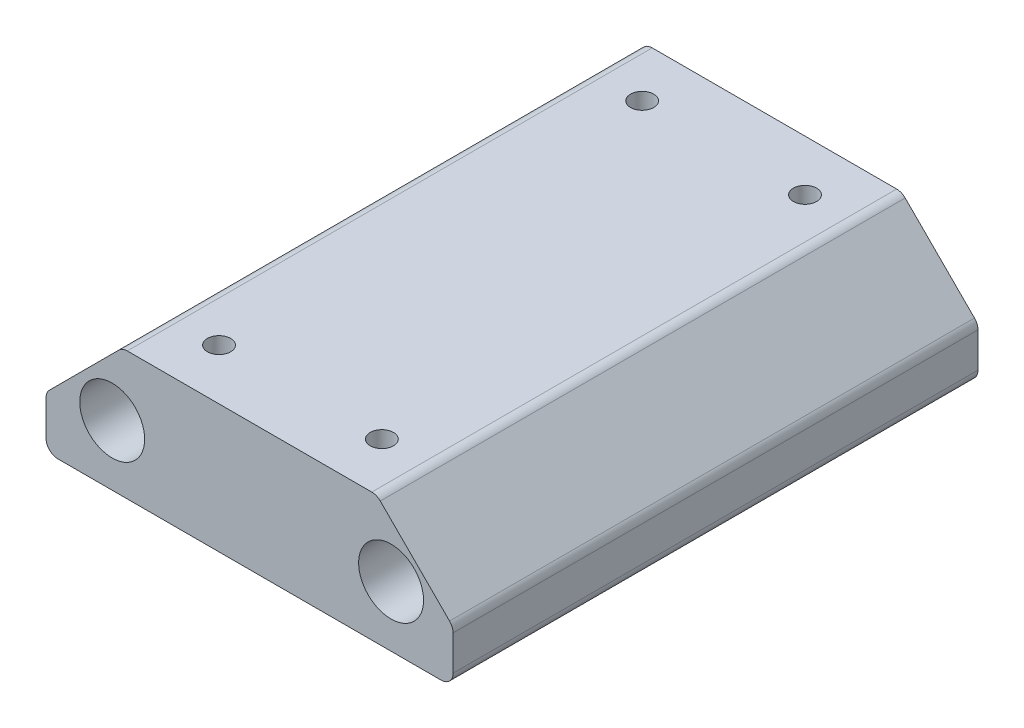
ISO-10303-21;
HEADER;
FILE_DESCRIPTION(('STEP AP214'),'2;1');
FILE_NAME('part.step','',(''),(''),'','','');
FILE_SCHEMA(('AUTOMOTIVE_DESIGN { 1 0 10303 214 1 1 1 1 }'));
ENDSEC;
DATA;
#1=APPLICATION_CONTEXT('core data for automotive mechanical design processes');
#2=APPLICATION_PROTOCOL_DEFINITION('international standard','automotive_design',2000,#1);
#3=PRODUCT_CONTEXT('',#1,'mechanical');
#4=PRODUCT('Part','Part','',(#3));
#5=PRODUCT_RELATED_PRODUCT_CATEGORY('part','',(#4));
#6=PRODUCT_DEFINITION_FORMATION('','',#4);
#7=PRODUCT_DEFINITION_CONTEXT('part definition',#1,'design');
#8=PRODUCT_DEFINITION('design','',#6,#7);
#9=PRODUCT_DEFINITION_SHAPE('','',#8);
#10=(LENGTH_UNIT() NAMED_UNIT(*) SI_UNIT(.MILLI.,.METRE.));
#11=(NAMED_UNIT(*) PLANE_ANGLE_UNIT() SI_UNIT($,.RADIAN.));
#12=(NAMED_UNIT(*) SI_UNIT($,.STERADIAN.) SOLID_ANGLE_UNIT());
#13=UNCERTAINTY_MEASURE_WITH_UNIT(LENGTH_MEASURE(1.E-05),#10,'distance_accuracy_value','');
#14=(GEOMETRIC_REPRESENTATION_CONTEXT(3) GLOBAL_UNCERTAINTY_ASSIGNED_CONTEXT((#13)) GLOBAL_UNIT_ASSIGNED_CONTEXT((#10,
#11,#12)) REPRESENTATION_CONTEXT('',''));
#15=CARTESIAN_POINT('',(0.,0.,0.));
#16=DIRECTION('',(0.,0.,1.));
#17=DIRECTION('',(1.,0.,0.));
#18=AXIS2_PLACEMENT_3D('',#15,#16,#17);
#19=CARTESIAN_POINT('',(-25.6620879768942,-140.149956673303,118.760116409937));
#20=DIRECTION('',(0.,-1.,0.));
#21=DIRECTION('',(0.,0.,-1.));
#22=AXIS2_PLACEMENT_3D('',#19,#20,#21);
#23=PLANE('',#22);
#24=CARTESIAN_POINT('',(9.89791202310576,-140.149956673303,6.35));
#25=DIRECTION('',(0.,-1.,0.));
#26=DIRECTION('',(0.,0.,-1.));
#27=AXIS2_PLACEMENT_3D('',#24,#25,#26);
#28=CIRCLE('',#27,1.45);
#29=CARTESIAN_POINT('',(9.89791202310576,-140.149956673303,4.9));
#30=VERTEX_POINT('',#29);
#31=EDGE_CURVE('E236',#30,#30,#28,.T.);
#32=ORIENTED_EDGE('',*,*,#31,.T.);
#33=EDGE_LOOP('',(#32));
#34=FACE_BOUND('',#33,.T.);
#35=CARTESIAN_POINT('',(-10.4220879768942,-140.149956673303,6.35));
#36=DIRECTION('',(0.,-1.,0.));
#37=DIRECTION('',(0.,0.,-1.));
#38=AXIS2_PLACEMENT_3D('',#35,#36,#37);
#39=CIRCLE('',#38,1.45);
#40=CARTESIAN_POINT('',(-10.4220879768942,-140.149956673303,4.9));
#41=VERTEX_POINT('',#40);
#42=EDGE_CURVE('E298',#41,#41,#39,.T.);
#43=ORIENTED_EDGE('',*,*,#42,.T.);
#44=EDGE_LOOP('',(#43));
#45=FACE_BOUND('',#44,.T.);
#46=CARTESIAN_POINT('',(9.89791202310575,-140.149956673303,59.1500000000001));
#47=DIRECTION('',(0.,-1.,0.));
#48=DIRECTION('',(0.,0.,-1.));
#49=AXIS2_PLACEMENT_3D('',#46,#47,#48);
#50=CIRCLE('',#49,1.45000000000039);
#51=CARTESIAN_POINT('',(9.89791202310575,-140.149956673303,57.6999999999997));
#52=VERTEX_POINT('',#51);
#53=EDGE_CURVE('E259',#52,#52,#50,.T.);
#54=ORIENTED_EDGE('',*,*,#53,.T.);
#55=EDGE_LOOP('',(#54));
#56=FACE_BOUND('',#55,.T.);
#57=CARTESIAN_POINT('',(-10.4220879768942,-140.149956673303,59.1500000000001));
#58=DIRECTION('',(0.,-1.,0.));
#59=DIRECTION('',(0.,0.,-1.));
#60=AXIS2_PLACEMENT_3D('',#57,#58,#59);
#61=CIRCLE('',#60,1.45000000000039);
#62=CARTESIAN_POINT('',(-10.4220879768942,-140.149956673303,57.6999999999997));
#63=VERTEX_POINT('',#62);
#64=EDGE_CURVE('E246',#63,#63,#61,.T.);
#65=ORIENTED_EDGE('',*,*,#64,.T.);
#66=EDGE_LOOP('',(#65));
#67=FACE_BOUND('',#66,.T.);
#68=DIRECTION('',(-1.,0.,0.));
#69=VECTOR('',#68,1.);
#70=CARTESIAN_POINT('',(-25.6620879768942,-140.149956673303,65.5000000000001));
#71=LINE('',#70,#69);
#72=CARTESIAN_POINT('',(14.9915916795461,-140.149956673303,65.5000000000001));
#73=VERTEX_POINT('',#72);
#74=CARTESIAN_POINT('',(-15.5157676333346,-140.149956673303,65.5000000000001));
#75=VERTEX_POINT('',#74);
#76=EDGE_CURVE('E256',#73,#75,#71,.T.);
#77=ORIENTED_EDGE('',*,*,#76,.F.);
#78=DIRECTION('',(0.,0.,1.));
#79=VECTOR('',#78,1.);
#80=CARTESIAN_POINT('',(14.9915916795461,-140.149956673303,0.));
#81=LINE('',#80,#79);
#82=CARTESIAN_POINT('',(14.9915916795461,-140.149956673303,0.));
#83=VERTEX_POINT('',#82);
#84=EDGE_CURVE('E229',#73,#83,#81,.F.);
#85=ORIENTED_EDGE('',*,*,#84,.T.);
#86=DIRECTION('',(-1.,0.,0.));
#87=VECTOR('',#86,1.);
#88=CARTESIAN_POINT('',(-25.6620879768942,-140.149956673303,0.));
#89=LINE('',#88,#87);
#90=CARTESIAN_POINT('',(-15.5157676333346,-140.149956673303,0.));
#91=VERTEX_POINT('',#90);
#92=EDGE_CURVE('E163',#83,#91,#89,.T.);
#93=ORIENTED_EDGE('',*,*,#92,.T.);
#94=DIRECTION('',(0.,0.,-1.));
#95=VECTOR('',#94,1.);
#96=CARTESIAN_POINT('',(-15.5157676333346,-140.149956673303,65.5000000000001));
#97=LINE('',#96,#95);
#98=EDGE_CURVE('E225',#91,#75,#97,.F.);
#99=ORIENTED_EDGE('',*,*,#98,.T.);
#100=EDGE_LOOP('',(#77,#85,#93,#99));
#101=FACE_BOUND('',#100,.T.);
#102=ADVANCED_FACE('F36',(#34,#45,#56,#67,#101),#23,.F.);
#103=CARTESIAN_POINT('',(25.1379120231058,-156.149956673303,118.760116409937));
#104=DIRECTION('',(-1.,0.,0.));
#105=DIRECTION('',(0.,0.,1.));
#106=AXIS2_PLACEMENT_3D('',#103,#104,#105);
#107=PLANE('',#106);
#108=DIRECTION('',(0.,1.,0.));
#109=VECTOR('',#108,1.);
#110=CARTESIAN_POINT('',(25.1379120231058,-156.149956673303,0.));
#111=LINE('',#110,#109);
#112=CARTESIAN_POINT('',(25.1379120231058,-154.649956673303,0.));
#113=VERTEX_POINT('',#112);
#114=CARTESIAN_POINT('',(25.1379120231058,-150.296277016863,0.));
#115=VERTEX_POINT('',#114);
#116=EDGE_CURVE('E243',#113,#115,#111,.T.);
#117=ORIENTED_EDGE('',*,*,#116,.T.);
#118=DIRECTION('',(0.,0.,-1.));
#119=VECTOR('',#118,1.);
#120=CARTESIAN_POINT('',(25.1379120231058,-150.296277016863,65.5000000000001));
#121=LINE('',#120,#119);
#122=CARTESIAN_POINT('',(25.1379120231058,-150.296277016863,65.5000000000001));
#123=VERTEX_POINT('',#122);
#124=EDGE_CURVE('E192',#115,#123,#121,.F.);
#125=ORIENTED_EDGE('',*,*,#124,.T.);
#126=DIRECTION('',(0.,1.,0.));
#127=VECTOR('',#126,1.);
#128=CARTESIAN_POINT('',(25.1379120231058,-156.149956673303,65.5000000000001));
#129=LINE('',#128,#127);
#130=CARTESIAN_POINT('',(25.1379120231058,-154.649956673303,65.5000000000001));
#131=VERTEX_POINT('',#130);
#132=EDGE_CURVE('E151',#131,#123,#129,.T.);
#133=ORIENTED_EDGE('',*,*,#132,.F.);
#134=DIRECTION('',(0.,0.,-1.));
#135=VECTOR('',#134,1.);
#136=CARTESIAN_POINT('',(25.1379120231058,-154.649956673303,118.760116409937));
#137=LINE('',#136,#135);
#138=EDGE_CURVE('E139',#131,#113,#137,.T.);
#139=ORIENTED_EDGE('',*,*,#138,.T.);
#140=EDGE_LOOP('',(#117,#125,#133,#139));
#141=FACE_BOUND('',#140,.T.);
#142=ADVANCED_FACE('F320',(#141),#107,.F.);
#143=CARTESIAN_POINT('',(-25.6620879768942,-156.149956673303,118.760116409937));
#144=DIRECTION('',(0.,1.,0.));
#145=DIRECTION('',(0.,0.,1.));
#146=AXIS2_PLACEMENT_3D('',#143,#144,#145);
#147=PLANE('',#146);
#148=CARTESIAN_POINT('',(9.89791202310576,-156.149956673303,6.35));
#149=DIRECTION('',(0.,-1.,0.));
#150=DIRECTION('',(0.,0.,-1.));
#151=AXIS2_PLACEMENT_3D('',#148,#149,#150);
#152=CIRCLE('',#151,1.45);
#153=CARTESIAN_POINT('',(9.89791202310576,-156.149956673303,4.9));
#154=VERTEX_POINT('',#153);
#155=EDGE_CURVE('E240',#154,#154,#152,.T.);
#156=ORIENTED_EDGE('',*,*,#155,.F.);
#157=EDGE_LOOP('',(#156));
#158=FACE_BOUND('',#157,.T.);
#159=CARTESIAN_POINT('',(-10.4220879768942,-156.149956673303,6.35));
#160=DIRECTION('',(0.,-1.,0.));
#161=DIRECTION('',(0.,0.,-1.));
#162=AXIS2_PLACEMENT_3D('',#159,#160,#161);
#163=CIRCLE('',#162,1.45);
#164=CARTESIAN_POINT('',(-10.4220879768942,-156.149956673303,4.9));
#165=VERTEX_POINT('',#164);
#166=EDGE_CURVE('E239',#165,#165,#163,.T.);
#167=ORIENTED_EDGE('',*,*,#166,.F.);
#168=EDGE_LOOP('',(#167));
#169=FACE_BOUND('',#168,.T.);
#170=CARTESIAN_POINT('',(9.89791202310575,-156.149956673303,59.1500000000001));
#171=DIRECTION('',(0.,-1.,0.));
#172=DIRECTION('',(0.,0.,-1.));
#173=AXIS2_PLACEMENT_3D('',#170,#171,#172);
#174=CIRCLE('',#173,1.45000000000039);
#175=CARTESIAN_POINT('',(9.89791202310575,-156.149956673303,57.6999999999997));
#176=VERTEX_POINT('',#175);
#177=EDGE_CURVE('E261',#176,#176,#174,.T.);
#178=ORIENTED_EDGE('',*,*,#177,.F.);
#179=EDGE_LOOP('',(#178));
#180=FACE_BOUND('',#179,.T.);
#181=CARTESIAN_POINT('',(-10.4220879768942,-156.149956673303,59.1500000000001));
#182=DIRECTION('',(0.,-1.,0.));
#183=DIRECTION('',(0.,0.,-1.));
#184=AXIS2_PLACEMENT_3D('',#181,#182,#183);
#185=CIRCLE('',#184,1.45000000000039);
#186=CARTESIAN_POINT('',(-10.4220879768942,-156.149956673303,57.6999999999997));
#187=VERTEX_POINT('',#186);
#188=EDGE_CURVE('E250',#187,#187,#185,.T.);
#189=ORIENTED_EDGE('',*,*,#188,.F.);
#190=EDGE_LOOP('',(#189));
#191=FACE_BOUND('',#190,.T.);
#192=DIRECTION('',(1.,0.,0.));
#193=VECTOR('',#192,1.);
#194=CARTESIAN_POINT('',(-25.6620879768942,-156.149956673303,65.5000000000001));
#195=LINE('',#194,#193);
#196=CARTESIAN_POINT('',(-24.1620879768942,-156.149956673303,65.5000000000001));
#197=VERTEX_POINT('',#196);
#198=CARTESIAN_POINT('',(23.6379120231058,-156.149956673303,65.5000000000001));
#199=VERTEX_POINT('',#198);
#200=EDGE_CURVE('E130',#197,#199,#195,.T.);
#201=ORIENTED_EDGE('',*,*,#200,.F.);
#202=DIRECTION('',(0.,0.,-1.));
#203=VECTOR('',#202,1.);
#204=CARTESIAN_POINT('',(-24.1620879768942,-156.149956673303,118.760116409937));
#205=LINE('',#204,#203);
#206=CARTESIAN_POINT('',(-24.1620879768942,-156.149956673303,0.));
#207=VERTEX_POINT('',#206);
#208=EDGE_CURVE('E146',#197,#207,#205,.T.);
#209=ORIENTED_EDGE('',*,*,#208,.T.);
#210=DIRECTION('',(1.,0.,0.));
#211=VECTOR('',#210,1.);
#212=CARTESIAN_POINT('',(-25.6620879768942,-156.149956673303,0.));
#213=LINE('',#212,#211);
#214=CARTESIAN_POINT('',(23.6379120231058,-156.149956673303,0.));
#215=VERTEX_POINT('',#214);
#216=EDGE_CURVE('E252',#207,#215,#213,.T.);
#217=ORIENTED_EDGE('',*,*,#216,.T.);
#218=DIRECTION('',(0.,0.,-1.));
#219=VECTOR('',#218,1.);
#220=CARTESIAN_POINT('',(23.6379120231058,-156.149956673303,118.760116409937));
#221=LINE('',#220,#219);
#222=EDGE_CURVE('E149',#215,#199,#221,.F.);
#223=ORIENTED_EDGE('',*,*,#222,.T.);
#224=EDGE_LOOP('',(#201,#209,#217,#223));
#225=FACE_BOUND('',#224,.T.);
#226=ADVANCED_FACE('F144',(#158,#169,#180,#191,#225),#147,.F.);
#227=CARTESIAN_POINT('',(-25.6620879768942,-156.149956673303,118.760116409937));
#228=DIRECTION('',(1.,0.,0.));
#229=DIRECTION('',(0.,0.,-1.));
#230=AXIS2_PLACEMENT_3D('',#227,#228,#229);
#231=PLANE('',#230);
#232=DIRECTION('',(0.,-1.,0.));
#233=VECTOR('',#232,1.);
#234=CARTESIAN_POINT('',(-25.6620879768942,-156.149956673303,65.5000000000001));
#235=LINE('',#234,#233);
#236=CARTESIAN_POINT('',(-25.6620879768942,-150.296277016863,65.5000000000001));
#237=VERTEX_POINT('',#236);
#238=CARTESIAN_POINT('',(-25.6620879768942,-154.649956673303,65.5000000000001));
#239=VERTEX_POINT('',#238);
#240=EDGE_CURVE('E133',#237,#239,#235,.T.);
#241=ORIENTED_EDGE('',*,*,#240,.F.);
#242=DIRECTION('',(0.,0.,1.));
#243=VECTOR('',#242,1.);
#244=CARTESIAN_POINT('',(-25.6620879768942,-150.296277016863,0.));
#245=LINE('',#244,#243);
#246=CARTESIAN_POINT('',(-25.6620879768942,-150.296277016863,0.));
#247=VERTEX_POINT('',#246);
#248=EDGE_CURVE('E11',#237,#247,#245,.F.);
#249=ORIENTED_EDGE('',*,*,#248,.T.);
#250=DIRECTION('',(0.,-1.,0.));
#251=VECTOR('',#250,1.);
#252=CARTESIAN_POINT('',(-25.6620879768942,-156.149956673303,0.));
#253=LINE('',#252,#251);
#254=CARTESIAN_POINT('',(-25.6620879768942,-154.649956673303,0.));
#255=VERTEX_POINT('',#254);
#256=EDGE_CURVE('E253',#247,#255,#253,.T.);
#257=ORIENTED_EDGE('',*,*,#256,.T.);
#258=DIRECTION('',(0.,0.,-1.));
#259=VECTOR('',#258,1.);
#260=CARTESIAN_POINT('',(-25.6620879768942,-154.649956673303,118.760116409937));
#261=LINE('',#260,#259);
#262=EDGE_CURVE('E169',#255,#239,#261,.F.);
#263=ORIENTED_EDGE('',*,*,#262,.T.);
#264=EDGE_LOOP('',(#241,#249,#257,#263));
#265=FACE_BOUND('',#264,.T.);
#266=ADVANCED_FACE('F319',(#265),#231,.F.);
#267=CARTESIAN_POINT('',(-17.4,-148.61842649073,118.760116409937));
#268=DIRECTION('',(0.,0.,-1.));
#269=DIRECTION('',(-1.,0.,0.));
#270=AXIS2_PLACEMENT_3D('',#267,#268,#269);
#271=CYLINDRICAL_SURFACE('',#270,4.05000000000018);
#272=CARTESIAN_POINT('',(-17.4,-148.61842649073,0.));
#273=DIRECTION('',(0.,0.,1.));
#274=DIRECTION('',(1.,0.,0.));
#275=AXIS2_PLACEMENT_3D('',#272,#273,#274);
#276=CIRCLE('',#275,4.05000000000018);
#277=CARTESIAN_POINT('',(-13.3499999999999,-148.61842649073,0.));
#278=VERTEX_POINT('',#277);
#279=EDGE_CURVE('E272',#278,#278,#276,.T.);
#280=ORIENTED_EDGE('',*,*,#279,.F.);
#281=EDGE_LOOP('',(#280));
#282=FACE_BOUND('',#281,.T.);
#283=CARTESIAN_POINT('',(-17.4,-148.61842649073,65.5000000000001));
#284=DIRECTION('',(0.,0.,1.));
#285=DIRECTION('',(1.,0.,0.));
#286=AXIS2_PLACEMENT_3D('',#283,#284,#285);
#287=CIRCLE('',#286,4.05000000000018);
#288=CARTESIAN_POINT('',(-13.3499999999999,-148.61842649073,65.5000000000001));
#289=VERTEX_POINT('',#288);
#290=EDGE_CURVE('E266',#289,#289,#287,.T.);
#291=ORIENTED_EDGE('',*,*,#290,.T.);
#292=EDGE_LOOP('',(#291));
#293=FACE_BOUND('',#292,.T.);
#294=ADVANCED_FACE('F355',(#282,#293),#271,.F.);
#295=CARTESIAN_POINT('',(0.,0.,0.));
#296=DIRECTION('',(0.,0.,-1.));
#297=DIRECTION('',(-1.,0.,0.));
#298=AXIS2_PLACEMENT_3D('',#295,#296,#297);
#299=PLANE('',#298);
#300=ORIENTED_EDGE('',*,*,#279,.T.);
#301=EDGE_LOOP('',(#300));
#302=FACE_BOUND('',#301,.T.);
#303=DIRECTION('',(-0.707106781186546,0.707106781186549,0.));
#304=VECTOR('',#303,1.);
#305=CARTESIAN_POINT('',(-62.2685223250985,-62.2685223250983,0.));
#306=LINE('',#305,#304);
#307=CARTESIAN_POINT('',(16.0522518513259,-140.589296501523,0.));
#308=VERTEX_POINT('',#307);
#309=CARTESIAN_POINT('',(24.6985721948856,-149.235616845083,0.));
#310=VERTEX_POINT('',#309);
#311=EDGE_CURVE('E180',#308,#310,#306,.F.);
#312=ORIENTED_EDGE('',*,*,#311,.T.);
#313=CARTESIAN_POINT('',(23.6379120231058,-150.296277016863,0.));
#314=DIRECTION('',(0.,0.,-1.));
#315=DIRECTION('',(-1.,0.,0.));
#316=AXIS2_PLACEMENT_3D('',#313,#314,#315);
#317=CIRCLE('',#316,1.5);
#318=EDGE_CURVE('E222',#310,#115,#317,.T.);
#319=ORIENTED_EDGE('',*,*,#318,.T.);
#320=ORIENTED_EDGE('',*,*,#116,.F.);
#321=CARTESIAN_POINT('',(23.6379120231058,-154.649956673303,0.));
#322=DIRECTION('',(0.,0.,-1.));
#323=DIRECTION('',(-1.,0.,0.));
#324=AXIS2_PLACEMENT_3D('',#321,#322,#323);
#325=CIRCLE('',#324,1.5);
#326=EDGE_CURVE('E157',#113,#215,#325,.T.);
#327=ORIENTED_EDGE('',*,*,#326,.T.);
#328=ORIENTED_EDGE('',*,*,#216,.F.);
#329=CARTESIAN_POINT('',(-24.1620879768942,-154.649956673303,0.));
#330=DIRECTION('',(0.,0.,-1.));
#331=DIRECTION('',(-1.,0.,0.));
#332=AXIS2_PLACEMENT_3D('',#329,#330,#331);
#333=CIRCLE('',#332,1.5);
#334=EDGE_CURVE('E155',#207,#255,#333,.T.);
#335=ORIENTED_EDGE('',*,*,#334,.T.);
#336=ORIENTED_EDGE('',*,*,#256,.F.);
#337=CARTESIAN_POINT('',(-24.1620879768942,-150.296277016863,0.));
#338=DIRECTION('',(0.,0.,-1.));
#339=DIRECTION('',(-1.,0.,0.));
#340=AXIS2_PLACEMENT_3D('',#337,#338,#339);
#341=CIRCLE('',#340,1.5);
#342=CARTESIAN_POINT('',(-25.2227481486741,-149.235616845083,0.));
#343=VERTEX_POINT('',#342);
#344=EDGE_CURVE('E58',#247,#343,#341,.T.);
#345=ORIENTED_EDGE('',*,*,#344,.T.);
#346=DIRECTION('',(-0.707106781186549,-0.707106781186546,0.));
#347=VECTOR('',#346,1.);
#348=CARTESIAN_POINT('',(62.0064343482044,-62.0064343482046,0.));
#349=LINE('',#348,#347);
#350=CARTESIAN_POINT('',(-16.5764278051144,-140.589296501523,0.));
#351=VERTEX_POINT('',#350);
#352=EDGE_CURVE('E177',#343,#351,#349,.F.);
#353=ORIENTED_EDGE('',*,*,#352,.T.);
#354=CARTESIAN_POINT('',(-15.5157676333346,-141.649956673303,0.));
#355=DIRECTION('',(0.,0.,-1.));
#356=DIRECTION('',(-1.,0.,0.));
#357=AXIS2_PLACEMENT_3D('',#354,#355,#356);
#358=CIRCLE('',#357,1.5);
#359=EDGE_CURVE('E216',#351,#91,#358,.T.);
#360=ORIENTED_EDGE('',*,*,#359,.T.);
#361=ORIENTED_EDGE('',*,*,#92,.F.);
#362=CARTESIAN_POINT('',(14.9915916795461,-141.649956673303,0.));
#363=DIRECTION('',(0.,0.,-1.));
#364=DIRECTION('',(-1.,0.,0.));
#365=AXIS2_PLACEMENT_3D('',#362,#363,#364);
#366=CIRCLE('',#365,1.5);
#367=EDGE_CURVE('E219',#83,#308,#366,.T.);
#368=ORIENTED_EDGE('',*,*,#367,.T.);
#369=EDGE_LOOP('',(#312,#319,#320,#327,#328,#335,#336,#345,#353,#360,#361,#368));
#370=FACE_BOUND('',#369,.T.);
#371=CARTESIAN_POINT('',(17.3999999999999,-148.61842649073,0.));
#372=DIRECTION('',(0.,0.,1.));
#373=DIRECTION('',(1.,0.,0.));
#374=AXIS2_PLACEMENT_3D('',#371,#372,#373);
#375=CIRCLE('',#374,4.05000000000016);
#376=CARTESIAN_POINT('',(21.4500000000001,-148.61842649073,0.));
#377=VERTEX_POINT('',#376);
#378=EDGE_CURVE('E269',#377,#377,#375,.T.);
#379=ORIENTED_EDGE('',*,*,#378,.T.);
#380=EDGE_LOOP('',(#379));
#381=FACE_BOUND('',#380,.T.);
#382=ADVANCED_FACE('F350',(#302,#370,#381),#299,.T.);
#383=CARTESIAN_POINT('',(17.3999999999999,-148.61842649073,118.760116409937));
#384=DIRECTION('',(0.,0.,-1.));
#385=DIRECTION('',(-1.,0.,0.));
#386=AXIS2_PLACEMENT_3D('',#383,#384,#385);
#387=CYLINDRICAL_SURFACE('',#386,4.05000000000016);
#388=ORIENTED_EDGE('',*,*,#378,.F.);
#389=EDGE_LOOP('',(#388));
#390=FACE_BOUND('',#389,.T.);
#391=CARTESIAN_POINT('',(17.3999999999999,-148.61842649073,65.5000000000001));
#392=DIRECTION('',(0.,0.,1.));
#393=DIRECTION('',(1.,0.,0.));
#394=AXIS2_PLACEMENT_3D('',#391,#392,#393);
#395=CIRCLE('',#394,4.05000000000016);
#396=CARTESIAN_POINT('',(21.4500000000001,-148.61842649073,65.5000000000001));
#397=VERTEX_POINT('',#396);
#398=EDGE_CURVE('E249',#397,#397,#395,.T.);
#399=ORIENTED_EDGE('',*,*,#398,.T.);
#400=EDGE_LOOP('',(#399));
#401=FACE_BOUND('',#400,.T.);
#402=ADVANCED_FACE('F402',(#390,#401),#387,.F.);
#403=CARTESIAN_POINT('',(0.,-1.98734618600535E-13,65.5000000000001));
#404=DIRECTION('',(0.,0.,1.));
#405=DIRECTION('',(0.,-1.,0.));
#406=AXIS2_PLACEMENT_3D('',#403,#404,#405);
#407=PLANE('',#406);
#408=ORIENTED_EDGE('',*,*,#398,.F.);
#409=EDGE_LOOP('',(#408));
#410=FACE_BOUND('',#409,.T.);
#411=ORIENTED_EDGE('',*,*,#290,.F.);
#412=EDGE_LOOP('',(#411));
#413=FACE_BOUND('',#412,.T.);
#414=ORIENTED_EDGE('',*,*,#132,.T.);
#415=CARTESIAN_POINT('',(23.6379120231058,-150.296277016863,65.5000000000001));
#416=DIRECTION('',(0.,0.,1.));
#417=DIRECTION('',(1.,0.,0.));
#418=AXIS2_PLACEMENT_3D('',#415,#416,#417);
#419=CIRCLE('',#418,1.5);
#420=CARTESIAN_POINT('',(24.6985721948856,-149.235616845083,65.5000000000001));
#421=VERTEX_POINT('',#420);
#422=EDGE_CURVE('E205',#123,#421,#419,.T.);
#423=ORIENTED_EDGE('',*,*,#422,.T.);
#424=DIRECTION('',(0.707106781186546,-0.707106781186549,0.));
#425=VECTOR('',#424,1.);
#426=CARTESIAN_POINT('',(-62.2685223250984,-62.2685223250984,65.5000000000001));
#427=LINE('',#426,#425);
#428=CARTESIAN_POINT('',(16.0522518513259,-140.589296501523,65.5000000000001));
#429=VERTEX_POINT('',#428);
#430=EDGE_CURVE('E188',#421,#429,#427,.F.);
#431=ORIENTED_EDGE('',*,*,#430,.T.);
#432=CARTESIAN_POINT('',(14.9915916795461,-141.649956673303,65.5000000000001));
#433=DIRECTION('',(0.,0.,1.));
#434=DIRECTION('',(1.,0.,0.));
#435=AXIS2_PLACEMENT_3D('',#432,#433,#434);
#436=CIRCLE('',#435,1.5);
#437=EDGE_CURVE('E202',#429,#73,#436,.T.);
#438=ORIENTED_EDGE('',*,*,#437,.T.);
#439=ORIENTED_EDGE('',*,*,#76,.T.);
#440=CARTESIAN_POINT('',(-15.5157676333346,-141.649956673303,65.5000000000001));
#441=DIRECTION('',(0.,0.,1.));
#442=DIRECTION('',(1.,0.,0.));
#443=AXIS2_PLACEMENT_3D('',#440,#441,#442);
#444=CIRCLE('',#443,1.5);
#445=CARTESIAN_POINT('',(-16.5764278051144,-140.589296501523,65.5000000000001));
#446=VERTEX_POINT('',#445);
#447=EDGE_CURVE('E199',#75,#446,#444,.T.);
#448=ORIENTED_EDGE('',*,*,#447,.T.);
#449=DIRECTION('',(0.707106781186549,0.707106781186546,0.));
#450=VECTOR('',#449,1.);
#451=CARTESIAN_POINT('',(62.0064343482043,-62.0064343482047,65.5000000000001));
#452=LINE('',#451,#450);
#453=CARTESIAN_POINT('',(-25.2227481486741,-149.235616845083,65.5000000000001));
#454=VERTEX_POINT('',#453);
#455=EDGE_CURVE('E184',#446,#454,#452,.F.);
#456=ORIENTED_EDGE('',*,*,#455,.T.);
#457=CARTESIAN_POINT('',(-24.1620879768942,-150.296277016863,65.5000000000001));
#458=DIRECTION('',(0.,0.,1.));
#459=DIRECTION('',(1.,0.,0.));
#460=AXIS2_PLACEMENT_3D('',#457,#458,#459);
#461=CIRCLE('',#460,1.5);
#462=EDGE_CURVE('E196',#454,#237,#461,.T.);
#463=ORIENTED_EDGE('',*,*,#462,.T.);
#464=ORIENTED_EDGE('',*,*,#240,.T.);
#465=CARTESIAN_POINT('',(-24.1620879768942,-154.649956673303,65.5000000000001));
#466=DIRECTION('',(0.,0.,1.));
#467=DIRECTION('',(1.,0.,0.));
#468=AXIS2_PLACEMENT_3D('',#465,#466,#467);
#469=CIRCLE('',#468,1.5);
#470=EDGE_CURVE('E126',#239,#197,#469,.T.);
#471=ORIENTED_EDGE('',*,*,#470,.T.);
#472=ORIENTED_EDGE('',*,*,#200,.T.);
#473=CARTESIAN_POINT('',(23.6379120231058,-154.649956673303,65.5000000000001));
#474=DIRECTION('',(0.,0.,1.));
#475=DIRECTION('',(1.,0.,0.));
#476=AXIS2_PLACEMENT_3D('',#473,#474,#475);
#477=CIRCLE('',#476,1.5);
#478=EDGE_CURVE('E140',#199,#131,#477,.T.);
#479=ORIENTED_EDGE('',*,*,#478,.T.);
#480=EDGE_LOOP('',(#414,#423,#431,#438,#439,#448,#456,#463,#464,#471,#472,#479));
#481=FACE_BOUND('',#480,.T.);
#482=ADVANCED_FACE('F129',(#410,#413,#481),#407,.T.);
#483=CARTESIAN_POINT('',(-24.1620879768942,-154.649956673303,118.760116409937));
#484=DIRECTION('',(0.,0.,-1.));
#485=DIRECTION('',(-1.,0.,0.));
#486=AXIS2_PLACEMENT_3D('',#483,#484,#485);
#487=CYLINDRICAL_SURFACE('',#486,1.5);
#488=ORIENTED_EDGE('',*,*,#470,.F.);
#489=ORIENTED_EDGE('',*,*,#262,.F.);
#490=ORIENTED_EDGE('',*,*,#334,.F.);
#491=ORIENTED_EDGE('',*,*,#208,.F.);
#492=EDGE_LOOP('',(#488,#489,#490,#491));
#493=FACE_BOUND('',#492,.T.);
#494=ADVANCED_FACE('F153',(#493),#487,.T.);
#495=CARTESIAN_POINT('',(23.6379120231058,-154.649956673303,118.760116409937));
#496=DIRECTION('',(0.,0.,-1.));
#497=DIRECTION('',(-1.,0.,0.));
#498=AXIS2_PLACEMENT_3D('',#495,#496,#497);
#499=CYLINDRICAL_SURFACE('',#498,1.5);
#500=ORIENTED_EDGE('',*,*,#478,.F.);
#501=ORIENTED_EDGE('',*,*,#222,.F.);
#502=ORIENTED_EDGE('',*,*,#326,.F.);
#503=ORIENTED_EDGE('',*,*,#138,.F.);
#504=EDGE_LOOP('',(#500,#501,#502,#503));
#505=FACE_BOUND('',#504,.T.);
#506=ADVANCED_FACE('F359',(#505),#499,.T.);
#507=CARTESIAN_POINT('',(15.6129120231058,-140.149956673303,118.760116409937));
#508=DIRECTION('',(-0.707106781186549,-0.707106781186546,0.));
#509=DIRECTION('',(0.,0.,-1.));
#510=AXIS2_PLACEMENT_3D('',#507,#508,#509);
#511=PLANE('',#510);
#512=ORIENTED_EDGE('',*,*,#430,.F.);
#513=DIRECTION('',(0.,0.,1.));
#514=VECTOR('',#513,1.);
#515=CARTESIAN_POINT('',(24.6985721948856,-149.235616845083,0.));
#516=LINE('',#515,#514);
#517=EDGE_CURVE('E211',#421,#310,#516,.F.);
#518=ORIENTED_EDGE('',*,*,#517,.T.);
#519=ORIENTED_EDGE('',*,*,#311,.F.);
#520=DIRECTION('',(0.,0.,-1.));
#521=VECTOR('',#520,1.);
#522=CARTESIAN_POINT('',(16.0522518513259,-140.589296501523,65.5000000000001));
#523=LINE('',#522,#521);
#524=EDGE_CURVE('E208',#308,#429,#523,.F.);
#525=ORIENTED_EDGE('',*,*,#524,.T.);
#526=EDGE_LOOP('',(#512,#518,#519,#525));
#527=FACE_BOUND('',#526,.T.);
#528=ADVANCED_FACE('F362',(#527),#511,.F.);
#529=CARTESIAN_POINT('',(-25.6620879768942,-149.674956673303,118.760116409937));
#530=DIRECTION('',(0.707106781186546,-0.707106781186549,0.));
#531=DIRECTION('',(0.,0.,-1.));
#532=AXIS2_PLACEMENT_3D('',#529,#530,#531);
#533=PLANE('',#532);
#534=ORIENTED_EDGE('',*,*,#455,.F.);
#535=DIRECTION('',(0.,0.,1.));
#536=VECTOR('',#535,1.);
#537=CARTESIAN_POINT('',(-16.5764278051144,-140.589296501523,0.));
#538=LINE('',#537,#536);
#539=EDGE_CURVE('E45',#446,#351,#538,.F.);
#540=ORIENTED_EDGE('',*,*,#539,.T.);
#541=ORIENTED_EDGE('',*,*,#352,.F.);
#542=DIRECTION('',(0.,0.,-1.));
#543=VECTOR('',#542,1.);
#544=CARTESIAN_POINT('',(-25.2227481486741,-149.235616845083,65.5000000000001));
#545=LINE('',#544,#543);
#546=EDGE_CURVE('E233',#343,#454,#545,.F.);
#547=ORIENTED_EDGE('',*,*,#546,.T.);
#548=EDGE_LOOP('',(#534,#540,#541,#547));
#549=FACE_BOUND('',#548,.T.);
#550=ADVANCED_FACE('F366',(#549),#533,.F.);
#551=CARTESIAN_POINT('',(23.6379120231058,-150.296277016863,118.760116409937));
#552=DIRECTION('',(0.,0.,1.));
#553=DIRECTION('',(1.,0.,0.));
#554=AXIS2_PLACEMENT_3D('',#551,#552,#553);
#555=CYLINDRICAL_SURFACE('',#554,1.5);
#556=ORIENTED_EDGE('',*,*,#318,.F.);
#557=ORIENTED_EDGE('',*,*,#517,.F.);
#558=ORIENTED_EDGE('',*,*,#422,.F.);
#559=ORIENTED_EDGE('',*,*,#124,.F.);
#560=EDGE_LOOP('',(#556,#557,#558,#559));
#561=FACE_BOUND('',#560,.T.);
#562=ADVANCED_FACE('F370',(#561),#555,.T.);
#563=CARTESIAN_POINT('',(14.9915916795461,-141.649956673303,118.760116409937));
#564=DIRECTION('',(0.,0.,-1.));
#565=DIRECTION('',(-1.,0.,0.));
#566=AXIS2_PLACEMENT_3D('',#563,#564,#565);
#567=CYLINDRICAL_SURFACE('',#566,1.5);
#568=ORIENTED_EDGE('',*,*,#437,.F.);
#569=ORIENTED_EDGE('',*,*,#524,.F.);
#570=ORIENTED_EDGE('',*,*,#367,.F.);
#571=ORIENTED_EDGE('',*,*,#84,.F.);
#572=EDGE_LOOP('',(#568,#569,#570,#571));
#573=FACE_BOUND('',#572,.T.);
#574=ADVANCED_FACE('F373',(#573),#567,.T.);
#575=CARTESIAN_POINT('',(-15.5157676333346,-141.649956673303,118.760116409937));
#576=DIRECTION('',(0.,0.,1.));
#577=DIRECTION('',(1.,0.,0.));
#578=AXIS2_PLACEMENT_3D('',#575,#576,#577);
#579=CYLINDRICAL_SURFACE('',#578,1.5);
#580=ORIENTED_EDGE('',*,*,#359,.F.);
#581=ORIENTED_EDGE('',*,*,#539,.F.);
#582=ORIENTED_EDGE('',*,*,#447,.F.);
#583=ORIENTED_EDGE('',*,*,#98,.F.);
#584=EDGE_LOOP('',(#580,#581,#582,#583));
#585=FACE_BOUND('',#584,.T.);
#586=ADVANCED_FACE('F337',(#585),#579,.T.);
#587=CARTESIAN_POINT('',(-24.1620879768942,-150.296277016863,118.760116409937));
#588=DIRECTION('',(0.,0.,-1.));
#589=DIRECTION('',(-1.,0.,0.));
#590=AXIS2_PLACEMENT_3D('',#587,#588,#589);
#591=CYLINDRICAL_SURFACE('',#590,1.5);
#592=ORIENTED_EDGE('',*,*,#462,.F.);
#593=ORIENTED_EDGE('',*,*,#546,.F.);
#594=ORIENTED_EDGE('',*,*,#344,.F.);
#595=ORIENTED_EDGE('',*,*,#248,.F.);
#596=EDGE_LOOP('',(#592,#593,#594,#595));
#597=FACE_BOUND('',#596,.T.);
#598=ADVANCED_FACE('F38',(#597),#591,.T.);
#599=CARTESIAN_POINT('',(-10.4220879768942,-140.149956673303,59.1500000000001));
#600=DIRECTION('',(0.,-1.,0.));
#601=DIRECTION('',(0.,0.,-1.));
#602=AXIS2_PLACEMENT_3D('',#599,#600,#601);
#603=CYLINDRICAL_SURFACE('',#602,1.45000000000039);
#604=ORIENTED_EDGE('',*,*,#64,.F.);
#605=EDGE_LOOP('',(#604));
#606=FACE_BOUND('',#605,.T.);
#607=ORIENTED_EDGE('',*,*,#188,.T.);
#608=EDGE_LOOP('',(#607));
#609=FACE_BOUND('',#608,.T.);
#610=ADVANCED_FACE('F327',(#606,#609),#603,.F.);
#611=CARTESIAN_POINT('',(9.89791202310575,-140.149956673303,59.1500000000001));
#612=DIRECTION('',(0.,-1.,0.));
#613=DIRECTION('',(0.,0.,-1.));
#614=AXIS2_PLACEMENT_3D('',#611,#612,#613);
#615=CYLINDRICAL_SURFACE('',#614,1.45000000000039);
#616=ORIENTED_EDGE('',*,*,#53,.F.);
#617=EDGE_LOOP('',(#616));
#618=FACE_BOUND('',#617,.T.);
#619=ORIENTED_EDGE('',*,*,#177,.T.);
#620=EDGE_LOOP('',(#619));
#621=FACE_BOUND('',#620,.T.);
#622=ADVANCED_FACE('F313',(#618,#621),#615,.F.);
#623=CARTESIAN_POINT('',(-10.4220879768942,-140.149956673303,6.35));
#624=DIRECTION('',(0.,-1.,0.));
#625=DIRECTION('',(0.,0.,-1.));
#626=AXIS2_PLACEMENT_3D('',#623,#624,#625);
#627=CYLINDRICAL_SURFACE('',#626,1.45);
#628=ORIENTED_EDGE('',*,*,#42,.F.);
#629=EDGE_LOOP('',(#628));
#630=FACE_BOUND('',#629,.T.);
#631=ORIENTED_EDGE('',*,*,#166,.T.);
#632=EDGE_LOOP('',(#631));
#633=FACE_BOUND('',#632,.T.);
#634=ADVANCED_FACE('F309',(#630,#633),#627,.F.);
#635=CARTESIAN_POINT('',(9.89791202310576,-140.149956673303,6.35));
#636=DIRECTION('',(0.,-1.,0.));
#637=DIRECTION('',(0.,0.,-1.));
#638=AXIS2_PLACEMENT_3D('',#635,#636,#637);
#639=CYLINDRICAL_SURFACE('',#638,1.45);
#640=ORIENTED_EDGE('',*,*,#31,.F.);
#641=EDGE_LOOP('',(#640));
#642=FACE_BOUND('',#641,.T.);
#643=ORIENTED_EDGE('',*,*,#155,.T.);
#644=EDGE_LOOP('',(#643));
#645=FACE_BOUND('',#644,.T.);
#646=ADVANCED_FACE('F312',(#642,#645),#639,.F.);
#647=CLOSED_SHELL('',(#102,#142,#226,#266,#294,#382,#402,#482,#494,#506,#528,#550,#562,#574,
#586,#598,#610,#622,#634,#646));
#648=MANIFOLD_SOLID_BREP('B2',#647);
#649=ADVANCED_BREP_SHAPE_REPRESENTATION('',(#18,#648),#14);
#650=SHAPE_DEFINITION_REPRESENTATION(#9,#649);
ENDSEC;
END-ISO-10303-21;
